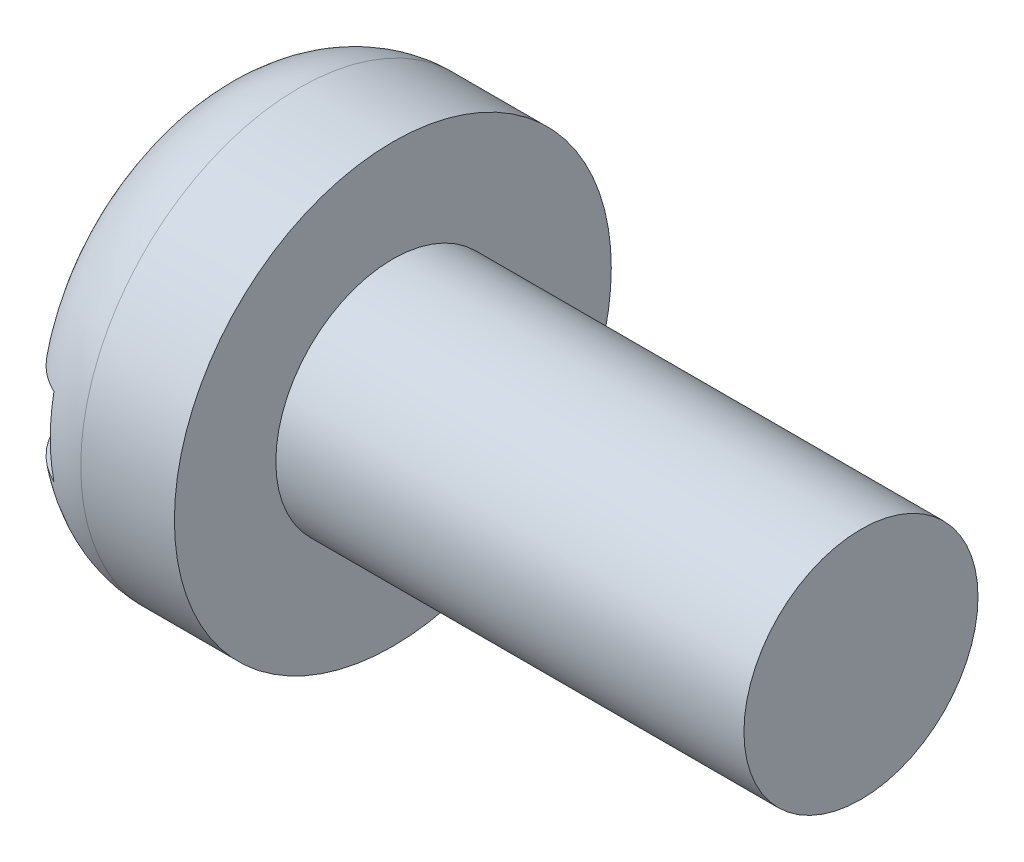
ISO-10303-21;
HEADER;
FILE_DESCRIPTION(('STEP AP214'),'2;1');
FILE_NAME('part.step','',(''),(''),'','','');
FILE_SCHEMA(('AUTOMOTIVE_DESIGN { 1 0 10303 214 1 1 1 1 }'));
ENDSEC;
DATA;
#1=APPLICATION_CONTEXT('core data for automotive mechanical design processes');
#2=APPLICATION_PROTOCOL_DEFINITION('international standard','automotive_design',2000,#1);
#3=PRODUCT_CONTEXT('',#1,'mechanical');
#4=PRODUCT('Part','Part','',(#3));
#5=PRODUCT_RELATED_PRODUCT_CATEGORY('part','',(#4));
#6=PRODUCT_DEFINITION_FORMATION('','',#4);
#7=PRODUCT_DEFINITION_CONTEXT('part definition',#1,'design');
#8=PRODUCT_DEFINITION('design','',#6,#7);
#9=PRODUCT_DEFINITION_SHAPE('','',#8);
#10=(LENGTH_UNIT() NAMED_UNIT(*) SI_UNIT(.MILLI.,.METRE.));
#11=(NAMED_UNIT(*) PLANE_ANGLE_UNIT() SI_UNIT($,.RADIAN.));
#12=(NAMED_UNIT(*) SI_UNIT($,.STERADIAN.) SOLID_ANGLE_UNIT());
#13=UNCERTAINTY_MEASURE_WITH_UNIT(LENGTH_MEASURE(1.E-05),#10,'distance_accuracy_value','');
#14=(GEOMETRIC_REPRESENTATION_CONTEXT(3) GLOBAL_UNCERTAINTY_ASSIGNED_CONTEXT((#13)) GLOBAL_UNIT_ASSIGNED_CONTEXT((#10,
#11,#12)) REPRESENTATION_CONTEXT('',''));
#15=CARTESIAN_POINT('',(0.,0.,0.));
#16=DIRECTION('',(0.,0.,1.));
#17=DIRECTION('',(1.,0.,0.));
#18=AXIS2_PLACEMENT_3D('',#15,#16,#17);
#19=CARTESIAN_POINT('',(0.,0.,0.));
#20=DIRECTION('',(-1.,0.,0.));
#21=DIRECTION('',(0.,0.,1.));
#22=AXIS2_PLACEMENT_3D('',#19,#20,#21);
#23=PLANE('',#22);
#24=DIRECTION('',(0.,0.,-1.));
#25=VECTOR('',#24,1.);
#26=CARTESIAN_POINT('',(0.,0.5,2.8));
#27=LINE('',#26,#25);
#28=CARTESIAN_POINT('',(0.,0.5,1.51986841535707));
#29=VERTEX_POINT('',#28);
#30=CARTESIAN_POINT('',(0.,0.5,-1.51986841535707));
#31=VERTEX_POINT('',#30);
#32=EDGE_CURVE('E90',#29,#31,#27,.T.);
#33=ORIENTED_EDGE('',*,*,#32,.F.);
#34=CARTESIAN_POINT('',(0.,0.,0.));
#35=DIRECTION('',(-1.,0.,0.));
#36=DIRECTION('',(0.,0.,1.));
#37=AXIS2_PLACEMENT_3D('',#34,#35,#36);
#38=CIRCLE('',#37,1.6);
#39=EDGE_CURVE('E96',#29,#31,#38,.T.);
#40=ORIENTED_EDGE('',*,*,#39,.T.);
#41=EDGE_LOOP('',(#33,#40));
#42=FACE_BOUND('',#41,.T.);
#43=ADVANCED_FACE('F35',(#42),#23,.T.);
#44=CARTESIAN_POINT('',(-25.4,0.,0.));
#45=DIRECTION('',(-1.,0.,0.));
#46=DIRECTION('',(0.,0.,1.));
#47=AXIS2_PLACEMENT_3D('',#44,#45,#46);
#48=CYLINDRICAL_SURFACE('',#47,1.5);
#49=CARTESIAN_POINT('',(8.4,0.,0.));
#50=DIRECTION('',(-1.,0.,0.));
#51=DIRECTION('',(0.,0.,1.));
#52=AXIS2_PLACEMENT_3D('',#49,#50,#51);
#53=CIRCLE('',#52,1.5);
#54=CARTESIAN_POINT('',(8.4,0.,1.5));
#55=VERTEX_POINT('',#54);
#56=EDGE_CURVE('E100',#55,#55,#53,.T.);
#57=ORIENTED_EDGE('',*,*,#56,.T.);
#58=EDGE_LOOP('',(#57));
#59=FACE_BOUND('',#58,.T.);
#60=CARTESIAN_POINT('',(2.4,0.,0.));
#61=DIRECTION('',(-1.,0.,0.));
#62=DIRECTION('',(0.,0.,1.));
#63=AXIS2_PLACEMENT_3D('',#60,#61,#62);
#64=CIRCLE('',#63,1.5);
#65=CARTESIAN_POINT('',(2.4,0.,1.5));
#66=VERTEX_POINT('',#65);
#67=EDGE_CURVE('E154',#66,#66,#64,.T.);
#68=ORIENTED_EDGE('',*,*,#67,.F.);
#69=EDGE_LOOP('',(#68));
#70=FACE_BOUND('',#69,.T.);
#71=ADVANCED_FACE('F37',(#59,#70),#48,.T.);
#72=CARTESIAN_POINT('',(8.4,1.5,0.));
#73=DIRECTION('',(1.,0.,0.));
#74=DIRECTION('',(0.,0.,-1.));
#75=AXIS2_PLACEMENT_3D('',#72,#73,#74);
#76=PLANE('',#75);
#77=ORIENTED_EDGE('',*,*,#56,.F.);
#78=EDGE_LOOP('',(#77));
#79=FACE_BOUND('',#78,.T.);
#80=ADVANCED_FACE('F140',(#79),#76,.T.);
#81=DIRECTION('',(0.,0.,1.));
#82=VECTOR('',#81,1.);
#83=CARTESIAN_POINT('',(0.,-0.5,-2.8));
#84=LINE('',#83,#82);
#85=CARTESIAN_POINT('',(0.,-0.5,-1.51986841535707));
#86=VERTEX_POINT('',#85);
#87=CARTESIAN_POINT('',(0.,-0.5,1.51986841535707));
#88=VERTEX_POINT('',#87);
#89=EDGE_CURVE('E80',#86,#88,#84,.T.);
#90=ORIENTED_EDGE('',*,*,#89,.F.);
#91=EDGE_CURVE('E88',#86,#88,#38,.T.);
#92=ORIENTED_EDGE('',*,*,#91,.T.);
#93=EDGE_LOOP('',(#90,#92));
#94=FACE_BOUND('',#93,.T.);
#95=ADVANCED_FACE('F87',(#94),#23,.T.);
#96=CARTESIAN_POINT('',(1.2,0.,0.));
#97=DIRECTION('',(-1.,0.,0.));
#98=DIRECTION('',(0.,0.,1.));
#99=AXIS2_PLACEMENT_3D('',#96,#97,#98);
#100=TOROIDAL_SURFACE('',#99,1.6,1.2);
#101=CARTESIAN_POINT('',(0.720416847668729,0.5,0.));
#102=CARTESIAN_POINT('',(0.720412048939506,0.5,-0.0146788740653849));
#103=CARTESIAN_POINT('',(0.718900005058829,0.5,-0.0293743594013442));
#104=CARTESIAN_POINT('',(0.713196307760751,0.5,-0.0582314558142323));
#105=CARTESIAN_POINT('',(0.708997536858259,0.5,-0.0723915427094973));
#106=CARTESIAN_POINT('',(0.693309219282968,0.5,-0.114409956528258));
#107=CARTESIAN_POINT('',(0.678789372523943,0.5,-0.141083554094184));
#108=CARTESIAN_POINT('',(0.65453117252026,0.5,-0.179480038766705));
#109=CARTESIAN_POINT('',(0.645971986817205,0.5,-0.192081809711115));
#110=CARTESIAN_POINT('',(0.628292913598712,0.5,-0.216887429916754));
#111=CARTESIAN_POINT('',(0.619173500677622,0.5,-0.229091602945133));
#112=CARTESIAN_POINT('',(0.58928909542451,0.5,-0.267955570022296));
#113=CARTESIAN_POINT('',(0.567877930367352,0.5,-0.294103724212001));
#114=CARTESIAN_POINT('',(0.524697591731276,0.5,-0.346107254729764));
#115=CARTESIAN_POINT('',(0.502928300356847,0.5,-0.371962529802993));
#116=CARTESIAN_POINT('',(0.459655347950245,0.5,-0.423933246090874));
#117=CARTESIAN_POINT('',(0.438151900919423,0.5,-0.450048869763751));
#118=CARTESIAN_POINT('',(0.395850370311951,0.5,-0.502843464044955));
#119=CARTESIAN_POINT('',(0.375052247373146,0.5,-0.529522403080959));
#120=CARTESIAN_POINT('',(0.3146760406643,0.5,-0.610072108297401));
#121=CARTESIAN_POINT('',(0.276572324816907,0.5,-0.665077713879425));
#122=CARTESIAN_POINT('',(0.206203592683588,0.5,-0.778740644765426));
#123=CARTESIAN_POINT('',(0.173935767455763,0.5,-0.837396194900226));
#124=CARTESIAN_POINT('',(0.128287337150005,0.5,-0.933666416052332));
#125=CARTESIAN_POINT('',(0.11255290526051,0.5,-0.970171571088427));
#126=CARTESIAN_POINT('',(0.0839111916245724,0.5,-1.04425975002071));
#127=CARTESIAN_POINT('',(0.0710031664681875,0.5,-1.0818424875396));
#128=CARTESIAN_POINT('',(0.0367430152837785,0.5,-1.19641692259309));
#129=CARTESIAN_POINT('',(0.0200305388466333,0.5,-1.27487203855227));
#130=CARTESIAN_POINT('',(0.000420190334342171,0.5,-1.43378681315729));
#131=CARTESIAN_POINT('',(-0.00242852843710768,0.5,-1.51425258889332));
#132=CARTESIAN_POINT('',(0.00661043116228892,0.5,-1.67422853423748));
#133=CARTESIAN_POINT('',(0.0184657642441854,0.5,-1.75374041423128));
#134=CARTESIAN_POINT('',(0.0555278787310516,0.5,-1.90338096962156));
#135=CARTESIAN_POINT('',(0.07968772128838,0.5,-1.97376952814821));
#136=CARTESIAN_POINT('',(0.140216328828218,0.5,-2.10913652108439));
#137=CARTESIAN_POINT('',(0.17658787517123,0.5,-2.17411371878068));
#138=CARTESIAN_POINT('',(0.258067772942611,0.5,-2.29279622478642));
#139=CARTESIAN_POINT('',(0.302540901549786,0.5,-2.34693847070913));
#140=CARTESIAN_POINT('',(0.400179741623309,0.5,-2.44670054764761));
#141=CARTESIAN_POINT('',(0.453342373557936,0.5,-2.49232338568601));
#142=CARTESIAN_POINT('',(0.565184949122136,0.5,-2.57243232600359));
#143=CARTESIAN_POINT('',(0.623663828630765,0.5,-2.60719940609085));
#144=CARTESIAN_POINT('',(0.745694220862918,0.5,-2.66625915000868));
#145=CARTESIAN_POINT('',(0.809245467302646,0.5,-2.69055236325726));
#146=CARTESIAN_POINT('',(0.938633102660402,0.5,-2.72764405658332));
#147=CARTESIAN_POINT('',(1.00442390217034,0.5,-2.74060172315222));
#148=CARTESIAN_POINT('',(1.13724772188345,0.5,-2.75521752081299));
#149=CARTESIAN_POINT('',(1.20428067923611,0.5,-2.75687622205126));
#150=CARTESIAN_POINT('',(1.33727947509462,0.5,-2.74886793643813));
#151=CARTESIAN_POINT('',(1.40324922473602,0.5,-2.73926569433155));
#152=CARTESIAN_POINT('',(1.53264139185229,0.5,-2.70913046977358));
#153=CARTESIAN_POINT('',(1.59606383061134,0.5,-2.68859757867418));
#154=CARTESIAN_POINT('',(1.7186322390957,0.5,-2.6371908799737));
#155=CARTESIAN_POINT('',(1.77777442017149,0.5,-2.60630804406282));
#156=CARTESIAN_POINT('',(1.89008423301934,0.5,-2.53512232010585));
#157=CARTESIAN_POINT('',(1.94325177051496,0.5,-2.49481928344531));
#158=CARTESIAN_POINT('',(2.04255909435002,0.5,-2.4056350076003));
#159=CARTESIAN_POINT('',(2.0886423445072,0.5,-2.35669084676903));
#160=CARTESIAN_POINT('',(2.1720920005339,0.5,-2.25186921229386));
#161=CARTESIAN_POINT('',(2.20945791884897,0.5,-2.19599135112041));
#162=CARTESIAN_POINT('',(2.27511560846889,0.5,-2.07792920658489));
#163=CARTESIAN_POINT('',(2.30324746217041,0.5,-2.01565607078024));
#164=CARTESIAN_POINT('',(2.34899520801394,0.5,-1.88737199408462));
#165=CARTESIAN_POINT('',(2.36661046744993,0.5,-1.82136082856547));
#166=CARTESIAN_POINT('',(2.39149402495405,0.5,-1.68532415521333));
#167=CARTESIAN_POINT('',(2.3984273556723,0.5,-1.61523762461022));
#168=CARTESIAN_POINT('',(2.40109497664014,0.5,-1.47486434156236));
#169=CARTESIAN_POINT('',(2.39682671941825,0.5,-1.40457754720461));
#170=CARTESIAN_POINT('',(2.37713279979807,0.5,-1.26144173670872));
#171=CARTESIAN_POINT('',(2.36107376853663,0.5,-1.18868087017303));
#172=CARTESIAN_POINT('',(2.31827392385857,0.5,-1.04643271957746));
#173=CARTESIAN_POINT('',(2.29153334587575,0.5,-0.976945363403316));
#174=CARTESIAN_POINT('',(2.22820539287413,0.5,-0.84064245715381));
#175=CARTESIAN_POINT('',(2.1913984356705,0.5,-0.773930118415685));
#176=CARTESIAN_POINT('',(2.13068854224584,0.5,-0.67742425783999));
#177=CARTESIAN_POINT('',(2.10953107287889,0.5,-0.645844100637181));
#178=CARTESIAN_POINT('',(2.06570120900225,0.5,-0.58375165344664));
#179=CARTESIAN_POINT('',(2.04302881931023,0.5,-0.553239360063411));
#180=CARTESIAN_POINT('',(1.99340521821554,0.5,-0.489029187138642));
#181=CARTESIAN_POINT('',(1.96629026133333,0.5,-0.455459230725844));
#182=CARTESIAN_POINT('',(1.91132292854589,0.5,-0.388899905487834));
#183=CARTESIAN_POINT('',(1.88346999390988,0.5,-0.355911009981945));
#184=CARTESIAN_POINT('',(1.83308026695119,0.5,-0.295284186504614));
#185=CARTESIAN_POINT('',(1.81046358416603,0.5,-0.267716541678173));
#186=CARTESIAN_POINT('',(1.77794009380934,0.5,-0.225293845551989));
#187=CARTESIAN_POINT('',(1.76733714557291,0.5,-0.210981344273506));
#188=CARTESIAN_POINT('',(1.74696819768187,0.5,-0.181778671923732));
#189=CARTESIAN_POINT('',(1.73720145292024,0.5,-0.166889032674253));
#190=CARTESIAN_POINT('',(1.72010709727067,0.5,-0.138007071069353));
#191=CARTESIAN_POINT('',(1.71262832821792,0.5,-0.124106262410648));
#192=CARTESIAN_POINT('',(1.69943337726656,0.5,-0.095485869622171));
#193=CARTESIAN_POINT('',(1.69371380414088,0.5,-0.0807679262112797));
#194=CARTESIAN_POINT('',(1.68568215352054,0.5,-0.0532047089195066));
#195=CARTESIAN_POINT('',(1.68294676600993,0.5,-0.0404875605954512));
#196=CARTESIAN_POINT('',(1.67971179374221,0.5,-0.0147761045896118));
#197=CARTESIAN_POINT('',(1.679208749399,0.5,-0.00178225715210458));
#198=CARTESIAN_POINT('',(1.68052751446953,0.5,0.0240807898150366));
#199=CARTESIAN_POINT('',(1.68234942039454,0.5,0.0369499841478375));
#200=CARTESIAN_POINT('',(1.6879936909762,0.5,0.0622348744202212));
#201=CARTESIAN_POINT('',(1.6918184032315,0.5,0.0746500198346486));
#202=CARTESIAN_POINT('',(1.70698999961767,0.5,0.115031156907352));
#203=CARTESIAN_POINT('',(1.72157783274798,0.5,0.141731770213744));
#204=CARTESIAN_POINT('',(1.74592839004157,0.5,0.180173151206379));
#205=CARTESIAN_POINT('',(1.75451879948002,0.5,0.192792979841256));
#206=CARTESIAN_POINT('',(1.77225759281355,0.5,0.217635884242998));
#207=CARTESIAN_POINT('',(1.78140548818868,0.5,0.229859293395018));
#208=CARTESIAN_POINT('',(1.81147920129928,0.5,0.268919293629982));
#209=CARTESIAN_POINT('',(1.83305443328386,0.5,0.295240791086562));
#210=CARTESIAN_POINT('',(1.87655279228466,0.5,0.347599299139574));
#211=CARTESIAN_POINT('',(1.898476031421,0.5,0.373636213292585));
#212=CARTESIAN_POINT('',(1.94204057295677,0.5,0.4259838895315));
#213=CARTESIAN_POINT('',(1.96368165035064,0.5,0.452294843267691));
#214=CARTESIAN_POINT('',(2.0062373123252,0.5,0.505496002557693));
#215=CARTESIAN_POINT('',(2.02715193858005,0.5,0.532386174739745));
#216=CARTESIAN_POINT('',(2.08782941410448,0.5,0.613578444152812));
#217=CARTESIAN_POINT('',(2.12608259418796,0.5,0.669039313585535));
#218=CARTESIAN_POINT('',(2.19662769211344,0.5,0.783667955402172));
#219=CARTESIAN_POINT('',(2.22892250726397,0.5,0.842833907309785));
#220=CARTESIAN_POINT('',(2.27433720539865,0.5,0.939598168799615));
#221=CARTESIAN_POINT('',(2.28988245443558,0.5,0.976065458154467));
#222=CARTESIAN_POINT('',(2.31814855286693,0.5,1.05006359532692));
#223=CARTESIAN_POINT('',(2.33087017043729,0.5,1.08759415073951));
#224=CARTESIAN_POINT('',(2.36458078861203,0.5,1.20199565103559));
#225=CARTESIAN_POINT('',(2.38093837262588,0.5,1.28030678271116));
#226=CARTESIAN_POINT('',(2.39988602839585,0.5,1.4388636645831));
#227=CARTESIAN_POINT('',(2.40242863431004,0.5,1.51911513431478));
#228=CARTESIAN_POINT('',(2.39285159877016,0.5,1.67861196744566));
#229=CARTESIAN_POINT('',(2.38076456351338,0.5,1.75785917192761));
#230=CARTESIAN_POINT('',(2.34330506107168,0.5,1.90710390538146));
#231=CARTESIAN_POINT('',(2.31894880228163,0.5,1.97735702229736));
#232=CARTESIAN_POINT('',(2.25806039890859,0.5,2.11242449895925));
#233=CARTESIAN_POINT('',(2.22152526656035,0.5,2.17723751923222));
#234=CARTESIAN_POINT('',(2.13974578708561,0.5,2.29560898573728));
#235=CARTESIAN_POINT('',(2.09512953553978,0.5,2.34960218269307));
#236=CARTESIAN_POINT('',(1.9972340255113,0.5,2.44904515707736));
#237=CARTESIAN_POINT('',(1.94395785390257,0.5,2.49449796637066));
#238=CARTESIAN_POINT('',(1.83191413875624,0.5,2.57426407833629));
#239=CARTESIAN_POINT('',(1.77334556280241,0.5,2.60885712496815));
#240=CARTESIAN_POINT('',(1.65116710151515,0.5,2.6675570909361));
#241=CARTESIAN_POINT('',(1.58755747460662,0.5,2.69166454739591));
#242=CARTESIAN_POINT('',(1.45808088321376,0.5,2.72838322048105));
#243=CARTESIAN_POINT('',(1.39225876799553,0.5,2.74115273974052));
#244=CARTESIAN_POINT('',(1.25940457101774,0.5,2.75539037676587));
#245=CARTESIAN_POINT('',(1.19237255007751,0.5,2.75685906102296));
#246=CARTESIAN_POINT('',(1.05940346375792,0.5,2.74847545994292));
#247=CARTESIAN_POINT('',(0.993462347878431,0.5,2.73868721980717));
#248=CARTESIAN_POINT('',(0.864158103248687,0.5,2.70818804455603));
#249=CARTESIAN_POINT('',(0.800794951921154,0.5,2.68747720512071));
#250=CARTESIAN_POINT('',(0.678370479734591,0.5,2.63572637335769));
#251=CARTESIAN_POINT('',(0.619313200240069,0.5,2.60467682575682));
#252=CARTESIAN_POINT('',(0.507199198586141,0.5,2.533174655288));
#253=CARTESIAN_POINT('',(0.454142588139967,0.5,2.49272185740448));
#254=CARTESIAN_POINT('',(0.355077249683983,0.5,2.40325528669718));
#255=CARTESIAN_POINT('',(0.309125718656175,0.5,2.35417821234334));
#256=CARTESIAN_POINT('',(0.225959213511305,0.5,2.24911537813744));
#257=CARTESIAN_POINT('',(0.188744650086003,0.5,2.19312929370763));
#258=CARTESIAN_POINT('',(0.123403665927523,0.5,2.07487127102478));
#259=CARTESIAN_POINT('',(0.0954381869490681,0.5,2.01251049073015));
#260=CARTESIAN_POINT('',(0.0500327139607367,0.5,1.88407806773448));
#261=CARTESIAN_POINT('',(0.0325936609497182,0.5,1.81800609385206));
#262=CARTESIAN_POINT('',(0.00807035990070532,0.5,1.68186325963989));
#263=CARTESIAN_POINT('',(0.00132324003223832,0.5,1.61173192382416));
#264=CARTESIAN_POINT('',(-0.000970280303857787,0.5,1.47130443774502));
#265=CARTESIAN_POINT('',(0.00348501772396007,0.5,1.40100826410356));
#266=CARTESIAN_POINT('',(0.0235592922884011,0.5,1.25786082286179));
#267=CARTESIAN_POINT('',(0.039814454923282,0.5,1.18509978035391));
#268=CARTESIAN_POINT('',(0.0829979154567985,0.5,1.04286773055095));
#269=CARTESIAN_POINT('',(0.109927504517887,0.5,0.973397122400261));
#270=CARTESIAN_POINT('',(0.174231842447952,0.5,0.835839235616107));
#271=CARTESIAN_POINT('',(0.212007827233687,0.5,0.767941604174001));
#272=CARTESIAN_POINT('',(0.274324681434463,0.5,0.669793476575604));
#273=CARTESIAN_POINT('',(0.296044427245421,0.5,0.637687270176176));
#274=CARTESIAN_POINT('',(0.341021418950139,0.5,0.574568112838904));
#275=CARTESIAN_POINT('',(0.364278656863147,0.5,0.543555156227544));
#276=CARTESIAN_POINT('',(0.421715763034677,0.5,0.469890356621665));
#277=CARTESIAN_POINT('',(0.456460905628147,0.5,0.427685707158088));
#278=CARTESIAN_POINT('',(0.509000463841133,0.5,0.36473897025106));
#279=CARTESIAN_POINT('',(0.526586441152036,0.5,0.343813868889916));
#280=CARTESIAN_POINT('',(0.561526271804658,0.5,0.301771093390046));
#281=CARTESIAN_POINT('',(0.578880169021486,0.5,0.280653456957152));
#282=CARTESIAN_POINT('',(0.611350030782391,0.5,0.239542801353554));
#283=CARTESIAN_POINT('',(0.626532079116805,0.5,0.219602337860429));
#284=CARTESIAN_POINT('',(0.655363349770752,0.5,0.178585081602678));
#285=CARTESIAN_POINT('',(0.669012907341737,0.5,0.157508538868636));
#286=CARTESIAN_POINT('',(0.688713433221444,0.5,0.121364952057118));
#287=CARTESIAN_POINT('',(0.695736483058075,0.5,0.106842871181539));
#288=CARTESIAN_POINT('',(0.707567025834921,0.5,0.0769323774264045));
#289=CARTESIAN_POINT('',(0.712383603956314,0.5,0.0615478152266143));
#290=CARTESIAN_POINT('',(0.717195405704537,0.5,0.0383063341287027));
#291=CARTESIAN_POINT('',(0.718395303280979,0.5,0.0306962694110572));
#292=CARTESIAN_POINT('',(0.720007304426356,0.5,0.0153923292146027));
#293=CARTESIAN_POINT('',(0.720419364399413,0.5,0.00769844912146684));
#294=CARTESIAN_POINT('',(0.720416847668729,0.5,0.));
#295=B_SPLINE_CURVE_WITH_KNOTS('',3,(#101,#102,#103,#104,#105,#106,#107,#108,#109,#110,#111,
#112,#113,#114,#115,#116,#117,#118,#119,#120,#121,#122,#123,#124,#125,#126,#127,#128,#129,#130,
#131,#132,#133,#134,#135,#136,#137,#138,#139,#140,#141,#142,#143,#144,#145,#146,#147,#148,#149,
#150,#151,#152,#153,#154,#155,#156,#157,#158,#159,#160,#161,#162,#163,#164,#165,#166,#167,#168,
#169,#170,#171,#172,#173,#174,#175,#176,#177,#178,#179,#180,#181,#182,#183,#184,#185,#186,#187,
#188,#189,#190,#191,#192,#193,#194,#195,#196,#197,#198,#199,#200,#201,#202,#203,#204,#205,#206,
#207,#208,#209,#210,#211,#212,#213,#214,#215,#216,#217,#218,#219,#220,#221,#222,#223,#224,#225,
#226,#227,#228,#229,#230,#231,#232,#233,#234,#235,#236,#237,#238,#239,#240,#241,#242,#243,#244,
#245,#246,#247,#248,#249,#250,#251,#252,#253,#254,#255,#256,#257,#258,#259,#260,#261,#262,#263,
#264,#265,#266,#267,#268,#269,#270,#271,#272,#273,#274,#275,#276,#277,#278,#279,#280,#281,#282,
#283,#284,#285,#286,#287,#288,#289,#290,#291,#292,#293,#294),.UNSPECIFIED.,.T.,.F.,(4,2,2,2,2,2,
2,2,2,2,2,2,2,2,2,2,2,2,2,2,2,2,2,2,2,2,2,2,2,2,2,2,2,2,2,2,2,2,2,2,2,2,2,2,2,2,2,2,2,2,2,2,2,2,
2,2,2,2,2,2,2,2,2,2,2,2,2,2,2,2,2,2,2,2,2,2,2,2,2,2,2,2,2,2,2,2,2,2,2,2,2,2,2,2,2,2,4),(0.,
0.0440007777412297,0.0881186045072467,0.178439883605835,0.224162667229457,0.269847237288864,
0.371215673713107,0.472618146887286,0.574097532607909,0.675571245698388,0.876045230357654,
1.07642246420042,1.19557056112835,1.31468728162284,1.55411672058773,1.7943944300659,
2.03414452398771,2.25624817905151,2.47840245521466,2.68756673920362,2.89665705613687,
3.09977266560002,3.30287761911757,3.50308231786231,3.70327691419209,3.9023261127386,
4.10137364777367,4.30059526689213,4.4998200291718,4.70056028055692,4.9013117565179,
5.10537604680919,5.30945261290898,5.51980706790488,5.73020936597511,5.9528267937843,
6.17543931511554,6.40335976126926,6.51736063431682,6.63136114484175,6.76079428687687,
6.89032839433744,6.9972691706472,7.05068967310576,7.10406206826374,7.15134355972014,
7.19853332630844,7.23739190284081,7.27619023700209,7.31499018177758,7.35383570822766,
7.44431654217307,7.4901379750172,7.535919816759,7.63800298964641,7.74011974728134,
7.84231348847933,7.94450135743529,8.14634438292021,8.34808900024359,8.46690950349688,
8.58569764160824,8.8244900860704,9.06410246310548,9.30318177972448,9.52509515660967,
9.74706301420022,9.95615575991408,10.1651741362104,10.3682553552604,10.5713261702616,
10.7715149375751,10.971693669708,11.1707391146137,11.369782815945,11.5690109910565,
11.768242874548,11.9690033344318,12.1697732294159,12.3738724766409,12.577989966404,
12.7884238578584,12.9988896569386,13.2216352359069,13.4444077660689,13.6768112621149,
13.7930633594148,13.9093148533253,14.073278798069,14.155283663767,14.2372728006877,
14.3124424153835,14.3875955536157,14.4358843891871,14.4839725669988,14.5070478386023,
14.5301243870649),.UNSPECIFIED.);
#296=CARTESIAN_POINT('',(0.7,0.5,-2.6440098102472));
#297=VERTEX_POINT('',#296);
#298=EDGE_CURVE('E11',#31,#297,#295,.T.);
#299=ORIENTED_EDGE('',*,*,#298,.F.);
#300=ORIENTED_EDGE('',*,*,#39,.F.);
#301=CARTESIAN_POINT('',(0.7,0.5,2.6440098102472));
#302=VERTEX_POINT('',#301);
#303=EDGE_CURVE('E39',#302,#29,#295,.T.);
#304=ORIENTED_EDGE('',*,*,#303,.F.);
#305=CARTESIAN_POINT('',(0.7,0.,0.));
#306=DIRECTION('',(-1.,0.,0.));
#307=DIRECTION('',(0.,0.,1.));
#308=AXIS2_PLACEMENT_3D('',#305,#306,#307);
#309=CIRCLE('',#308,2.69087121146357);
#310=CARTESIAN_POINT('',(0.7,-0.500000000000001,2.6440098102472));
#311=VERTEX_POINT('',#310);
#312=EDGE_CURVE('E108',#302,#311,#309,.F.);
#313=ORIENTED_EDGE('',*,*,#312,.T.);
#314=CARTESIAN_POINT('',(0.720416847668728,-0.5,0.));
#315=CARTESIAN_POINT('',(0.720412048939506,-0.5,0.0146788740653833));
#316=CARTESIAN_POINT('',(0.718900005058828,-0.5,0.0293743594013425));
#317=CARTESIAN_POINT('',(0.713196307760751,-0.5,0.0582314558142304));
#318=CARTESIAN_POINT('',(0.708997536858258,-0.5,0.0723915427094951));
#319=CARTESIAN_POINT('',(0.693309219282968,-0.5,0.114409956528255));
#320=CARTESIAN_POINT('',(0.678789372523944,-0.5,0.14108355409418));
#321=CARTESIAN_POINT('',(0.654531172520263,-0.5,0.1794800387667));
#322=CARTESIAN_POINT('',(0.645971986817208,-0.5,0.192081809711109));
#323=CARTESIAN_POINT('',(0.628292913598716,-0.5,0.216887429916747));
#324=CARTESIAN_POINT('',(0.619173500677627,-0.5,0.229091602945126));
#325=CARTESIAN_POINT('',(0.589289095424516,-0.5,0.267955570022288));
#326=CARTESIAN_POINT('',(0.567877930367359,-0.5,0.294103724211991));
#327=CARTESIAN_POINT('',(0.524697591731285,-0.5,0.346107254729753));
#328=CARTESIAN_POINT('',(0.502928300356857,-0.5,0.37196252980298));
#329=CARTESIAN_POINT('',(0.459655347950258,-0.5,0.423933246090859));
#330=CARTESIAN_POINT('',(0.438151900919437,-0.5,0.450048869763735));
#331=CARTESIAN_POINT('',(0.395850370311966,-0.5,0.502843464044936));
#332=CARTESIAN_POINT('',(0.375052247373162,-0.5,0.529522403080938));
#333=CARTESIAN_POINT('',(0.314676040664318,-0.5,0.610072108297376));
#334=CARTESIAN_POINT('',(0.276572324816926,-0.5,0.665077713879397));
#335=CARTESIAN_POINT('',(0.206203592683607,-0.5,0.778740644765391));
#336=CARTESIAN_POINT('',(0.173935767455783,-0.5,0.837396194900187));
#337=CARTESIAN_POINT('',(0.128287337150024,-0.5,0.933666416052291));
#338=CARTESIAN_POINT('',(0.112552905260527,-0.5,0.970171571088386));
#339=CARTESIAN_POINT('',(0.083911191624587,-0.5,1.04425975002067));
#340=CARTESIAN_POINT('',(0.0710031664682007,-0.5,1.08184248753956));
#341=CARTESIAN_POINT('',(0.0367430152837878,-0.5,1.19641692259306));
#342=CARTESIAN_POINT('',(0.0200305388466402,-0.5,1.27487203855223));
#343=CARTESIAN_POINT('',(0.000420190334344427,-0.5,1.43378681315726));
#344=CARTESIAN_POINT('',(-0.00242852843710774,-0.5,1.51425258889329));
#345=CARTESIAN_POINT('',(0.00661043116228494,-0.5,1.67422853423745));
#346=CARTESIAN_POINT('',(0.0184657642441799,-0.5,1.75374041423125));
#347=CARTESIAN_POINT('',(0.0555278787310435,-0.5,1.90338096962154));
#348=CARTESIAN_POINT('',(0.0796877212883706,-0.5,1.97376952814818));
#349=CARTESIAN_POINT('',(0.140216328828206,-0.5,2.10913652108436));
#350=CARTESIAN_POINT('',(0.176587875171217,-0.5,2.17411371878066));
#351=CARTESIAN_POINT('',(0.258067772942596,-0.5,2.2927962247864));
#352=CARTESIAN_POINT('',(0.30254090154977,-0.5,2.34693847070911));
#353=CARTESIAN_POINT('',(0.400179741623292,-0.5,2.44670054764759));
#354=CARTESIAN_POINT('',(0.453342373557918,-0.500000000000001,2.49232338568599));
#355=CARTESIAN_POINT('',(0.565184949122116,-0.500000000000001,2.57243232600357));
#356=CARTESIAN_POINT('',(0.623663828630745,-0.500000000000001,2.60719940609084));
#357=CARTESIAN_POINT('',(0.745694220862896,-0.500000000000001,2.66625915000867));
#358=CARTESIAN_POINT('',(0.809245467302623,-0.500000000000001,2.69055236325725));
#359=CARTESIAN_POINT('',(0.938633102660379,-0.500000000000001,2.72764405658332));
#360=CARTESIAN_POINT('',(1.00442390217032,-0.500000000000001,2.74060172315222));
#361=CARTESIAN_POINT('',(1.13724772188343,-0.500000000000001,2.75521752081298));
#362=CARTESIAN_POINT('',(1.20428067923609,-0.500000000000001,2.75687622205126));
#363=CARTESIAN_POINT('',(1.33727947509459,-0.500000000000001,2.74886793643813));
#364=CARTESIAN_POINT('',(1.40324922473599,-0.500000000000001,2.73926569433156));
#365=CARTESIAN_POINT('',(1.53264139185226,-0.500000000000001,2.70913046977358));
#366=CARTESIAN_POINT('',(1.59606383061132,-0.500000000000001,2.68859757867419));
#367=CARTESIAN_POINT('',(1.71863223909568,-0.500000000000001,2.63719087997371));
#368=CARTESIAN_POINT('',(1.77777442017147,-0.500000000000001,2.60630804406283));
#369=CARTESIAN_POINT('',(1.89008423301932,-0.500000000000001,2.53512232010586));
#370=CARTESIAN_POINT('',(1.94325177051494,-0.500000000000001,2.49481928344532));
#371=CARTESIAN_POINT('',(2.04255909435001,-0.500000000000001,2.40563500760032));
#372=CARTESIAN_POINT('',(2.08864234450719,-0.5,2.35669084676905));
#373=CARTESIAN_POINT('',(2.17209200053389,-0.5,2.25186921229388));
#374=CARTESIAN_POINT('',(2.20945791884895,-0.5,2.19599135112043));
#375=CARTESIAN_POINT('',(2.27511560846888,-0.5,2.07792920658492));
#376=CARTESIAN_POINT('',(2.3032474621704,-0.5,2.01565607078026));
#377=CARTESIAN_POINT('',(2.34899520801393,-0.5,1.88737199408464));
#378=CARTESIAN_POINT('',(2.36661046744992,-0.5,1.82136082856549));
#379=CARTESIAN_POINT('',(2.39149402495405,-0.5,1.68532415521335));
#380=CARTESIAN_POINT('',(2.3984273556723,-0.5,1.61523762461024));
#381=CARTESIAN_POINT('',(2.40109497664014,-0.5,1.47486434156238));
#382=CARTESIAN_POINT('',(2.39682671941826,-0.5,1.40457754720463));
#383=CARTESIAN_POINT('',(2.37713279979807,-0.5,1.26144173670875));
#384=CARTESIAN_POINT('',(2.36107376853664,-0.5,1.18868087017306));
#385=CARTESIAN_POINT('',(2.31827392385858,-0.5,1.04643271957749));
#386=CARTESIAN_POINT('',(2.29153334587576,-0.5,0.976945363403341));
#387=CARTESIAN_POINT('',(2.22820539287414,-0.5,0.840642457153843));
#388=CARTESIAN_POINT('',(2.19139843567052,-0.5,0.773930118415725));
#389=CARTESIAN_POINT('',(2.13068854224588,-0.5,0.67742425784004));
#390=CARTESIAN_POINT('',(2.10953107287893,-0.5,0.645844100637235));
#391=CARTESIAN_POINT('',(2.06570120900229,-0.5,0.5837516534467));
#392=CARTESIAN_POINT('',(2.04302881931028,-0.5,0.553239360063475));
#393=CARTESIAN_POINT('',(1.99340521821559,-0.5,0.489029187138706));
#394=CARTESIAN_POINT('',(1.96629026133338,-0.5,0.455459230725906));
#395=CARTESIAN_POINT('',(1.91132292854594,-0.5,0.388899905487893));
#396=CARTESIAN_POINT('',(1.88346999390993,-0.5,0.355911009982002));
#397=CARTESIAN_POINT('',(1.83308026695125,-0.5,0.295284186504685));
#398=CARTESIAN_POINT('',(1.8104635841661,-0.5,0.26771654167826));
#399=CARTESIAN_POINT('',(1.77794009380942,-0.5,0.2252938455521));
#400=CARTESIAN_POINT('',(1.767337145573,-0.5,0.210981344273626));
#401=CARTESIAN_POINT('',(1.74696819768196,-0.5,0.181778671923871));
#402=CARTESIAN_POINT('',(1.73720145292034,-0.5,0.166889032674402));
#403=CARTESIAN_POINT('',(1.72010709727076,-0.5,0.13800707106951));
#404=CARTESIAN_POINT('',(1.712628328218,-0.5,0.124106262410802));
#405=CARTESIAN_POINT('',(1.69943337726662,-0.5,0.0954858696223188));
#406=CARTESIAN_POINT('',(1.69371380414093,-0.5,0.0807679262114241));
#407=CARTESIAN_POINT('',(1.68568215352058,-0.5,0.0532047089196458));
#408=CARTESIAN_POINT('',(1.68294676600996,-0.5,0.0404875605955888));
#409=CARTESIAN_POINT('',(1.67971179374222,-0.5,0.014776104589745));
#410=CARTESIAN_POINT('',(1.679208749399,-0.5,0.00178225715223469));
#411=CARTESIAN_POINT('',(1.68052751446952,-0.5,-0.0240807898149142));
#412=CARTESIAN_POINT('',(1.68234942039452,-0.5,-0.0369499841477196));
#413=CARTESIAN_POINT('',(1.68799369097617,-0.5,-0.0622348744201132));
#414=CARTESIAN_POINT('',(1.69181840323146,-0.5,-0.0746500198345457));
#415=CARTESIAN_POINT('',(1.70698999961761,-0.5,-0.115031156907219));
#416=CARTESIAN_POINT('',(1.72157783274789,-0.5,-0.14173177021358));
#417=CARTESIAN_POINT('',(1.74592839004144,-0.5,-0.180173151206169));
#418=CARTESIAN_POINT('',(1.75451879947987,-0.5,-0.192792979841031));
#419=CARTESIAN_POINT('',(1.77225759281336,-0.5,-0.217635884242744));
#420=CARTESIAN_POINT('',(1.78140548818848,-0.5,-0.229859293394749));
#421=CARTESIAN_POINT('',(1.81147920129902,-0.5,-0.268919293629654));
#422=CARTESIAN_POINT('',(1.83305443328355,-0.5,-0.29524079108619));
#423=CARTESIAN_POINT('',(1.87655279228427,-0.5,-0.347599299139109));
#424=CARTESIAN_POINT('',(1.89847603142058,-0.5,-0.373636213292073));
#425=CARTESIAN_POINT('',(1.94204057295626,-0.5,-0.425983889530889));
#426=CARTESIAN_POINT('',(1.9636816503501,-0.5,-0.452294843267029));
#427=CARTESIAN_POINT('',(2.00623731232459,-0.5,-0.505496002556925));
#428=CARTESIAN_POINT('',(2.02715193857942,-0.5,-0.532386174738921));
#429=CARTESIAN_POINT('',(2.08782941410377,-0.5,-0.613578444151819));
#430=CARTESIAN_POINT('',(2.12608259418722,-0.5,-0.66903931358442));
#431=CARTESIAN_POINT('',(2.19662769211266,-0.5,-0.783667955400802));
#432=CARTESIAN_POINT('',(2.22892250726318,-0.5,-0.842833907308279));
#433=CARTESIAN_POINT('',(2.27433720539792,-0.5,-0.939598168797978));
#434=CARTESIAN_POINT('',(2.28988245443491,-0.5,-0.97606545815284));
#435=CARTESIAN_POINT('',(2.31814855286636,-0.5,-1.05006359532531));
#436=CARTESIAN_POINT('',(2.33087017043677,-0.5,-1.08759415073792));
#437=CARTESIAN_POINT('',(2.36458078861167,-0.5,-1.20199565103404));
#438=CARTESIAN_POINT('',(2.38093837262561,-0.5,-1.28030678270965));
#439=CARTESIAN_POINT('',(2.39988602839577,-0.5,-1.43886366458169));
#440=CARTESIAN_POINT('',(2.40242863431004,-0.5,-1.51911513431343));
#441=CARTESIAN_POINT('',(2.39285159877031,-0.5,-1.67861196744443));
#442=CARTESIAN_POINT('',(2.38076456351359,-0.5,-1.75785917192646));
#443=CARTESIAN_POINT('',(2.34330506107201,-0.5,-1.90710390538042));
#444=CARTESIAN_POINT('',(2.31894880228201,-0.5,-1.97735702229636));
#445=CARTESIAN_POINT('',(2.25806039890907,-0.5,-2.11242449895833));
#446=CARTESIAN_POINT('',(2.22152526656088,-0.5,-2.17723751923135));
#447=CARTESIAN_POINT('',(2.13974578708622,-0.5,-2.2956089857365));
#448=CARTESIAN_POINT('',(2.09512953554044,-0.5,-2.34960218269232));
#449=CARTESIAN_POINT('',(1.99723402551203,-0.5,-2.4490451570767));
#450=CARTESIAN_POINT('',(1.94395785390333,-0.5,-2.49449796637005));
#451=CARTESIAN_POINT('',(1.83191413875706,-0.5,-2.57426407833578));
#452=CARTESIAN_POINT('',(1.77334556280325,-0.5,-2.60885712496769));
#453=CARTESIAN_POINT('',(1.65116710151603,-0.5,-2.66755709093574));
#454=CARTESIAN_POINT('',(1.58755747460752,-0.5,-2.6916645473956));
#455=CARTESIAN_POINT('',(1.45808088321468,-0.5,-2.72838322048084));
#456=CARTESIAN_POINT('',(1.39225876799646,-0.5,-2.74115273974037));
#457=CARTESIAN_POINT('',(1.25940457101868,-0.5,-2.75539037676582));
#458=CARTESIAN_POINT('',(1.19237255007844,-0.5,-2.75685906102297));
#459=CARTESIAN_POINT('',(1.05940346375885,-0.5,-2.74847545994303));
#460=CARTESIAN_POINT('',(0.993462347879354,-0.5,-2.73868721980733));
#461=CARTESIAN_POINT('',(0.864158103249585,-0.5,-2.7081880445563));
#462=CARTESIAN_POINT('',(0.800794951922034,-0.5,-2.68747720512102));
#463=CARTESIAN_POINT('',(0.678370479735431,-0.5,-2.6357263733581));
#464=CARTESIAN_POINT('',(0.619313200240885,-0.5,-2.60467682575728));
#465=CARTESIAN_POINT('',(0.507199198586903,-0.5,-2.53317465528855));
#466=CARTESIAN_POINT('',(0.454142588140697,-0.5,-2.49272185740507));
#467=CARTESIAN_POINT('',(0.355077249684645,-0.5,-2.40325528669785));
#468=CARTESIAN_POINT('',(0.3091257186568,-0.5,-2.35417821234404));
#469=CARTESIAN_POINT('',(0.22595921351185,-0.5,-2.24911537813821));
#470=CARTESIAN_POINT('',(0.188744650086506,-0.5,-2.19312929370843));
#471=CARTESIAN_POINT('',(0.123403665927937,-0.5,-2.07487127102564));
#472=CARTESIAN_POINT('',(0.0954381869494357,-0.5,-2.01251049073104));
#473=CARTESIAN_POINT('',(0.0500327139610082,-0.5,-1.8840780677354));
#474=CARTESIAN_POINT('',(0.0325936609499403,-0.5,-1.818006093853));
#475=CARTESIAN_POINT('',(0.00807035990082618,-0.5,-1.68186325964086));
#476=CARTESIAN_POINT('',(0.00132324003230696,-0.5,-1.61173192382514));
#477=CARTESIAN_POINT('',(-0.000970280303893914,-0.5,-1.47130443774602));
#478=CARTESIAN_POINT('',(0.00348501772387133,-0.5,-1.40100826410456));
#479=CARTESIAN_POINT('',(0.0235592922882052,-0.5,-1.25786082286279));
#480=CARTESIAN_POINT('',(0.0398144549230307,-0.5,-1.18509978035492));
#481=CARTESIAN_POINT('',(0.0829979154564392,-0.5,-1.04286773055196));
#482=CARTESIAN_POINT('',(0.109927504517475,-0.5,-0.973397122401257));
#483=CARTESIAN_POINT('',(0.174231842447259,-0.5,-0.835839235617468));
#484=CARTESIAN_POINT('',(0.212007827232712,-0.5,-0.767941604175707));
#485=CARTESIAN_POINT('',(0.274324681433021,-0.5,-0.66979347657779));
#486=CARTESIAN_POINT('',(0.296044427243815,-0.5,-0.637687270178516));
#487=CARTESIAN_POINT('',(0.341021418948198,-0.5,-0.574568112841542));
#488=CARTESIAN_POINT('',(0.364278656861035,-0.5,-0.543555156230327));
#489=CARTESIAN_POINT('',(0.421715763032604,-0.5,-0.469890356624221));
#490=CARTESIAN_POINT('',(0.456460905626316,-0.5,-0.427685707160296));
#491=CARTESIAN_POINT('',(0.509000463839696,-0.5,-0.364738970252773));
#492=CARTESIAN_POINT('',(0.526586441150737,-0.5,-0.343813868891468));
#493=CARTESIAN_POINT('',(0.561526271803641,-0.5,-0.301771093391282));
#494=CARTESIAN_POINT('',(0.578880169020613,-0.5,-0.280653456958233));
#495=CARTESIAN_POINT('',(0.611350030781723,-0.5,-0.239542801354423));
#496=CARTESIAN_POINT('',(0.626532079116201,-0.5,-0.219602337861244));
#497=CARTESIAN_POINT('',(0.655363349770284,-0.5,-0.178585081603386));
#498=CARTESIAN_POINT('',(0.66901290734134,-0.5,-0.157508538869292));
#499=CARTESIAN_POINT('',(0.688713433221152,-0.5,-0.1213649520577));
#500=CARTESIAN_POINT('',(0.69573648305782,-0.5,-0.106842871182103));
#501=CARTESIAN_POINT('',(0.707567025834744,-0.5,-0.0769323774269305));
#502=CARTESIAN_POINT('',(0.712383603956177,-0.5,-0.0615478152271188));
#503=CARTESIAN_POINT('',(0.717195405704469,-0.5,-0.0383063341291054));
#504=CARTESIAN_POINT('',(0.718395303280936,-0.5,-0.0306962694113815));
#505=CARTESIAN_POINT('',(0.720007304426346,-0.5,-0.0153923292147673));
#506=CARTESIAN_POINT('',(0.720419364399412,-0.5,-0.00769844912154998));
#507=CARTESIAN_POINT('',(0.720416847668728,-0.5,0.));
#508=B_SPLINE_CURVE_WITH_KNOTS('',3,(#314,#315,#316,#317,#318,#319,#320,#321,#322,#323,#324,
#325,#326,#327,#328,#329,#330,#331,#332,#333,#334,#335,#336,#337,#338,#339,#340,#341,#342,#343,
#344,#345,#346,#347,#348,#349,#350,#351,#352,#353,#354,#355,#356,#357,#358,#359,#360,#361,#362,
#363,#364,#365,#366,#367,#368,#369,#370,#371,#372,#373,#374,#375,#376,#377,#378,#379,#380,#381,
#382,#383,#384,#385,#386,#387,#388,#389,#390,#391,#392,#393,#394,#395,#396,#397,#398,#399,#400,
#401,#402,#403,#404,#405,#406,#407,#408,#409,#410,#411,#412,#413,#414,#415,#416,#417,#418,#419,
#420,#421,#422,#423,#424,#425,#426,#427,#428,#429,#430,#431,#432,#433,#434,#435,#436,#437,#438,
#439,#440,#441,#442,#443,#444,#445,#446,#447,#448,#449,#450,#451,#452,#453,#454,#455,#456,#457,
#458,#459,#460,#461,#462,#463,#464,#465,#466,#467,#468,#469,#470,#471,#472,#473,#474,#475,#476,
#477,#478,#479,#480,#481,#482,#483,#484,#485,#486,#487,#488,#489,#490,#491,#492,#493,#494,#495,
#496,#497,#498,#499,#500,#501,#502,#503,#504,#505,#506,#507),.UNSPECIFIED.,.T.,.F.,(4,2,2,2,2,2,
2,2,2,2,2,2,2,2,2,2,2,2,2,2,2,2,2,2,2,2,2,2,2,2,2,2,2,2,2,2,2,2,2,2,2,2,2,2,2,2,2,2,2,2,2,2,2,2,
2,2,2,2,2,2,2,2,2,2,2,2,2,2,2,2,2,2,2,2,2,2,2,2,2,2,2,2,2,2,2,2,2,2,2,2,2,2,2,2,2,2,4),(0.,
0.0440007777412296,0.088118604507246,0.178439883605831,0.224162667229451,0.269847237288856,
0.371215673713095,0.472618146887269,0.574097532607887,0.675571245698362,0.876045230357619,
1.07642246420037,1.1955705611283,1.3146872816228,1.5541167205877,1.79439443006587,
2.03414452398768,2.25624817905149,2.47840245521464,2.6875667392036,2.89665705613685,
3.0997726656,3.30287761911755,3.50308231786229,3.70327691419207,3.90232611273858,
4.10137364777365,4.30059526689211,4.49982002917178,4.7005602805569,4.90131175651787,
5.10537604680917,5.30945261290895,5.51980706790486,5.73020936597509,5.95282679378428,
6.17543931511551,6.4033597612692,6.51736063431674,6.63136114484167,6.76079428687679,
6.89032839433737,6.99726917064707,7.0506896731056,7.10406206826355,7.15134355971997,
7.19853332630829,7.23739190284067,7.27619023700197,7.31499018177746,7.35383570822755,
7.44431654217284,7.49013797501691,7.53591981675864,7.63800298964586,7.74011974728061,
7.84231348847841,7.94450135743418,8.14634438291875,8.34808900024177,8.46690950349515,
8.58569764160659,8.82449008606893,9.06410246310419,9.30318177972337,9.52509515660861,
9.74706301419922,9.95615575991309,10.1651741362094,10.3682553552594,10.5713261702607,
10.7715149375741,10.9716936697071,11.1707391146127,11.369782815944,11.5690109910556,
11.768242874547,11.9690033344308,12.169773229415,12.37387247664,12.577989966403,
12.7884238578574,12.9988896569375,13.2216352359058,13.4444077660678,13.6768112621125,
13.7930633594117,13.9093148533216,14.0732787980665,14.1552836637652,14.2372728006865,
14.3124424153826,14.387595553615,14.4358843891865,14.4839725669983,14.5070478386021,
14.5301243870649),.UNSPECIFIED.);
#509=EDGE_CURVE('E84',#88,#311,#508,.T.);
#510=ORIENTED_EDGE('',*,*,#509,.F.);
#511=ORIENTED_EDGE('',*,*,#91,.F.);
#512=CARTESIAN_POINT('',(0.7,-0.5,-2.6440098102472));
#513=VERTEX_POINT('',#512);
#514=EDGE_CURVE('E48',#513,#86,#508,.T.);
#515=ORIENTED_EDGE('',*,*,#514,.F.);
#516=EDGE_CURVE('E60',#513,#297,#309,.F.);
#517=ORIENTED_EDGE('',*,*,#516,.T.);
#518=EDGE_LOOP('',(#299,#300,#304,#313,#510,#511,#515,#517));
#519=FACE_BOUND('',#518,.T.);
#520=CARTESIAN_POINT('',(1.2,0.,0.));
#521=DIRECTION('',(-1.,0.,0.));
#522=DIRECTION('',(0.,0.,1.));
#523=AXIS2_PLACEMENT_3D('',#520,#521,#522);
#524=CIRCLE('',#523,2.8);
#525=CARTESIAN_POINT('',(1.2,0.,2.8));
#526=VERTEX_POINT('',#525);
#527=EDGE_CURVE('E97',#526,#526,#524,.T.);
#528=ORIENTED_EDGE('',*,*,#527,.T.);
#529=EDGE_LOOP('',(#528));
#530=FACE_BOUND('',#529,.T.);
#531=ADVANCED_FACE('F93',(#519,#530),#100,.T.);
#532=CARTESIAN_POINT('',(-25.4,0.,0.));
#533=DIRECTION('',(-1.,0.,0.));
#534=DIRECTION('',(0.,0.,1.));
#535=AXIS2_PLACEMENT_3D('',#532,#533,#534);
#536=CYLINDRICAL_SURFACE('',#535,2.8);
#537=CARTESIAN_POINT('',(2.4,0.,0.));
#538=DIRECTION('',(-1.,0.,0.));
#539=DIRECTION('',(0.,0.,1.));
#540=AXIS2_PLACEMENT_3D('',#537,#538,#539);
#541=CIRCLE('',#540,2.8);
#542=CARTESIAN_POINT('',(2.4,0.,2.8));
#543=VERTEX_POINT('',#542);
#544=EDGE_CURVE('E102',#543,#543,#541,.T.);
#545=ORIENTED_EDGE('',*,*,#544,.T.);
#546=EDGE_LOOP('',(#545));
#547=FACE_BOUND('',#546,.T.);
#548=ORIENTED_EDGE('',*,*,#527,.F.);
#549=EDGE_LOOP('',(#548));
#550=FACE_BOUND('',#549,.T.);
#551=ADVANCED_FACE('F126',(#547,#550),#536,.T.);
#552=CARTESIAN_POINT('',(2.4,1.5,0.));
#553=DIRECTION('',(-1.,0.,0.));
#554=DIRECTION('',(0.,0.,1.));
#555=AXIS2_PLACEMENT_3D('',#552,#553,#554);
#556=PLANE('',#555);
#557=ORIENTED_EDGE('',*,*,#544,.F.);
#558=EDGE_LOOP('',(#557));
#559=FACE_BOUND('',#558,.T.);
#560=ORIENTED_EDGE('',*,*,#67,.T.);
#561=EDGE_LOOP('',(#560));
#562=FACE_BOUND('',#561,.T.);
#563=ADVANCED_FACE('F123',(#559,#562),#556,.F.);
#564=CARTESIAN_POINT('',(0.7,0.5,2.8));
#565=DIRECTION('',(0.,1.,0.));
#566=DIRECTION('',(0.,0.,1.));
#567=AXIS2_PLACEMENT_3D('',#564,#565,#566);
#568=PLANE('',#567);
#569=ORIENTED_EDGE('',*,*,#298,.T.);
#570=DIRECTION('',(0.,0.,-1.));
#571=VECTOR('',#570,1.);
#572=CARTESIAN_POINT('',(0.7,0.5,2.8));
#573=LINE('',#572,#571);
#574=EDGE_CURVE('E89',#302,#297,#573,.T.);
#575=ORIENTED_EDGE('',*,*,#574,.F.);
#576=ORIENTED_EDGE('',*,*,#303,.T.);
#577=ORIENTED_EDGE('',*,*,#32,.T.);
#578=EDGE_LOOP('',(#569,#575,#576,#577));
#579=FACE_BOUND('',#578,.T.);
#580=ADVANCED_FACE('F119',(#579),#568,.F.);
#581=CARTESIAN_POINT('',(0.7,-0.5,-2.8));
#582=DIRECTION('',(0.,-1.,0.));
#583=DIRECTION('',(0.,0.,-1.));
#584=AXIS2_PLACEMENT_3D('',#581,#582,#583);
#585=PLANE('',#584);
#586=ORIENTED_EDGE('',*,*,#509,.T.);
#587=DIRECTION('',(0.,0.,1.));
#588=VECTOR('',#587,1.);
#589=CARTESIAN_POINT('',(0.7,-0.5,-2.8));
#590=LINE('',#589,#588);
#591=EDGE_CURVE('E55',#513,#311,#590,.T.);
#592=ORIENTED_EDGE('',*,*,#591,.F.);
#593=ORIENTED_EDGE('',*,*,#514,.T.);
#594=ORIENTED_EDGE('',*,*,#89,.T.);
#595=EDGE_LOOP('',(#586,#592,#593,#594));
#596=FACE_BOUND('',#595,.T.);
#597=ADVANCED_FACE('F79',(#596),#585,.F.);
#598=CARTESIAN_POINT('',(0.7,0.5,-2.8));
#599=DIRECTION('',(-1.,0.,0.));
#600=DIRECTION('',(0.,0.,1.));
#601=AXIS2_PLACEMENT_3D('',#598,#599,#600);
#602=PLANE('',#601);
#603=ORIENTED_EDGE('',*,*,#591,.T.);
#604=ORIENTED_EDGE('',*,*,#312,.F.);
#605=ORIENTED_EDGE('',*,*,#574,.T.);
#606=ORIENTED_EDGE('',*,*,#516,.F.);
#607=EDGE_LOOP('',(#603,#604,#605,#606));
#608=FACE_BOUND('',#607,.T.);
#609=ADVANCED_FACE('F118',(#608),#602,.T.);
#610=CLOSED_SHELL('',(#43,#71,#80,#95,#531,#551,#563,#580,#597,#609));
#611=MANIFOLD_SOLID_BREP('B2',#610);
#612=ADVANCED_BREP_SHAPE_REPRESENTATION('',(#18,#611),#14);
#613=SHAPE_DEFINITION_REPRESENTATION(#9,#612);
ENDSEC;
END-ISO-10303-21;
